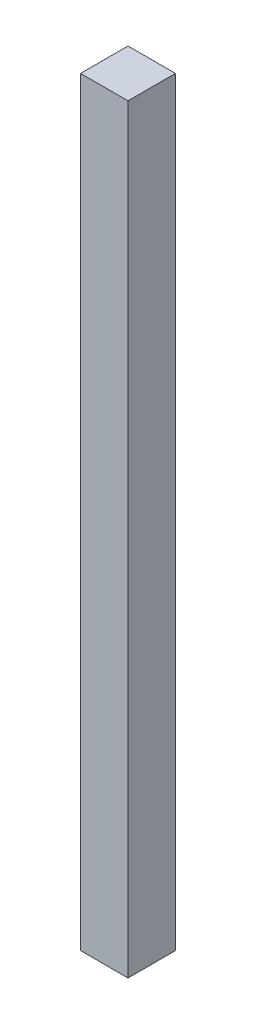
ISO-10303-21;
HEADER;
FILE_DESCRIPTION(('STEP AP214'),'2;1');
FILE_NAME('part.step','',(''),(''),'','','');
FILE_SCHEMA(('AUTOMOTIVE_DESIGN { 1 0 10303 214 1 1 1 1 }'));
ENDSEC;
DATA;
#1=APPLICATION_CONTEXT('core data for automotive mechanical design processes');
#2=APPLICATION_PROTOCOL_DEFINITION('international standard','automotive_design',2000,#1);
#3=PRODUCT_CONTEXT('',#1,'mechanical');
#4=PRODUCT('Part','Part','',(#3));
#5=PRODUCT_RELATED_PRODUCT_CATEGORY('part','',(#4));
#6=PRODUCT_DEFINITION_FORMATION('','',#4);
#7=PRODUCT_DEFINITION_CONTEXT('part definition',#1,'design');
#8=PRODUCT_DEFINITION('design','',#6,#7);
#9=PRODUCT_DEFINITION_SHAPE('','',#8);
#10=(LENGTH_UNIT() NAMED_UNIT(*) SI_UNIT(.MILLI.,.METRE.));
#11=(NAMED_UNIT(*) PLANE_ANGLE_UNIT() SI_UNIT($,.RADIAN.));
#12=(NAMED_UNIT(*) SI_UNIT($,.STERADIAN.) SOLID_ANGLE_UNIT());
#13=UNCERTAINTY_MEASURE_WITH_UNIT(LENGTH_MEASURE(1.E-05),#10,'distance_accuracy_value','');
#14=(GEOMETRIC_REPRESENTATION_CONTEXT(3) GLOBAL_UNCERTAINTY_ASSIGNED_CONTEXT((#13)) GLOBAL_UNIT_ASSIGNED_CONTEXT((#10,
#11,#12)) REPRESENTATION_CONTEXT('',''));
#15=CARTESIAN_POINT('',(0.,0.,0.));
#16=DIRECTION('',(0.,0.,1.));
#17=DIRECTION('',(1.,0.,0.));
#18=AXIS2_PLACEMENT_3D('',#15,#16,#17);
#19=CARTESIAN_POINT('',(10.,320.,10.));
#20=DIRECTION('',(-1.,0.,0.));
#21=DIRECTION('',(0.,0.,1.));
#22=AXIS2_PLACEMENT_3D('',#19,#20,#21);
#23=PLANE('',#22);
#24=DIRECTION('',(0.,0.,-1.));
#25=VECTOR('',#24,1.);
#26=CARTESIAN_POINT('',(10.,0.,10.));
#27=LINE('',#26,#25);
#28=CARTESIAN_POINT('',(10.,0.,10.));
#29=VERTEX_POINT('',#28);
#30=CARTESIAN_POINT('',(10.,0.,-10.));
#31=VERTEX_POINT('',#30);
#32=EDGE_CURVE('E96',#29,#31,#27,.T.);
#33=ORIENTED_EDGE('',*,*,#32,.T.);
#34=DIRECTION('',(0.,-1.,0.));
#35=VECTOR('',#34,1.);
#36=CARTESIAN_POINT('',(10.,320.,-10.));
#37=LINE('',#36,#35);
#38=CARTESIAN_POINT('',(10.,320.,-10.));
#39=VERTEX_POINT('',#38);
#40=EDGE_CURVE('E11',#39,#31,#37,.T.);
#41=ORIENTED_EDGE('',*,*,#40,.F.);
#42=DIRECTION('',(0.,0.,-1.));
#43=VECTOR('',#42,1.);
#44=CARTESIAN_POINT('',(10.,320.,10.));
#45=LINE('',#44,#43);
#46=CARTESIAN_POINT('',(10.,320.,10.));
#47=VERTEX_POINT('',#46);
#48=EDGE_CURVE('E84',#47,#39,#45,.T.);
#49=ORIENTED_EDGE('',*,*,#48,.F.);
#50=DIRECTION('',(0.,-1.,0.));
#51=VECTOR('',#50,1.);
#52=CARTESIAN_POINT('',(10.,320.,10.));
#53=LINE('',#52,#51);
#54=EDGE_CURVE('E92',#47,#29,#53,.T.);
#55=ORIENTED_EDGE('',*,*,#54,.T.);
#56=EDGE_LOOP('',(#33,#41,#49,#55));
#57=FACE_BOUND('',#56,.T.);
#58=ADVANCED_FACE('F33',(#57),#23,.F.);
#59=CARTESIAN_POINT('',(-10.,320.,-10.));
#60=DIRECTION('',(0.,0.,1.));
#61=DIRECTION('',(1.,0.,0.));
#62=AXIS2_PLACEMENT_3D('',#59,#60,#61);
#63=PLANE('',#62);
#64=DIRECTION('',(-1.,0.,0.));
#65=VECTOR('',#64,1.);
#66=CARTESIAN_POINT('',(-10.,0.,-10.));
#67=LINE('',#66,#65);
#68=CARTESIAN_POINT('',(-10.,0.,-10.));
#69=VERTEX_POINT('',#68);
#70=EDGE_CURVE('E88',#31,#69,#67,.T.);
#71=ORIENTED_EDGE('',*,*,#70,.T.);
#72=DIRECTION('',(0.,-1.,0.));
#73=VECTOR('',#72,1.);
#74=CARTESIAN_POINT('',(-10.,320.,-10.));
#75=LINE('',#74,#73);
#76=CARTESIAN_POINT('',(-10.,320.,-10.));
#77=VERTEX_POINT('',#76);
#78=EDGE_CURVE('E41',#77,#69,#75,.T.);
#79=ORIENTED_EDGE('',*,*,#78,.F.);
#80=DIRECTION('',(-1.,0.,0.));
#81=VECTOR('',#80,1.);
#82=CARTESIAN_POINT('',(-10.,320.,-10.));
#83=LINE('',#82,#81);
#84=EDGE_CURVE('E79',#39,#77,#83,.T.);
#85=ORIENTED_EDGE('',*,*,#84,.F.);
#86=ORIENTED_EDGE('',*,*,#40,.T.);
#87=EDGE_LOOP('',(#71,#79,#85,#86));
#88=FACE_BOUND('',#87,.T.);
#89=ADVANCED_FACE('F87',(#88),#63,.F.);
#90=CARTESIAN_POINT('',(-10.,320.,10.));
#91=DIRECTION('',(1.,0.,0.));
#92=DIRECTION('',(0.,0.,-1.));
#93=AXIS2_PLACEMENT_3D('',#90,#91,#92);
#94=PLANE('',#93);
#95=DIRECTION('',(0.,0.,1.));
#96=VECTOR('',#95,1.);
#97=CARTESIAN_POINT('',(-10.,0.,10.));
#98=LINE('',#97,#96);
#99=CARTESIAN_POINT('',(-10.,0.,10.));
#100=VERTEX_POINT('',#99);
#101=EDGE_CURVE('E66',#69,#100,#98,.T.);
#102=ORIENTED_EDGE('',*,*,#101,.T.);
#103=DIRECTION('',(0.,-1.,0.));
#104=VECTOR('',#103,1.);
#105=CARTESIAN_POINT('',(-10.,320.,10.));
#106=LINE('',#105,#104);
#107=CARTESIAN_POINT('',(-10.,320.,10.));
#108=VERTEX_POINT('',#107);
#109=EDGE_CURVE('E89',#108,#100,#106,.T.);
#110=ORIENTED_EDGE('',*,*,#109,.F.);
#111=DIRECTION('',(0.,0.,1.));
#112=VECTOR('',#111,1.);
#113=CARTESIAN_POINT('',(-10.,320.,10.));
#114=LINE('',#113,#112);
#115=EDGE_CURVE('E82',#77,#108,#114,.T.);
#116=ORIENTED_EDGE('',*,*,#115,.F.);
#117=ORIENTED_EDGE('',*,*,#78,.T.);
#118=EDGE_LOOP('',(#102,#110,#116,#117));
#119=FACE_BOUND('',#118,.T.);
#120=ADVANCED_FACE('F90',(#119),#94,.F.);
#121=CARTESIAN_POINT('',(-10.,320.,10.));
#122=DIRECTION('',(0.,0.,-1.));
#123=DIRECTION('',(-1.,0.,0.));
#124=AXIS2_PLACEMENT_3D('',#121,#122,#123);
#125=PLANE('',#124);
#126=DIRECTION('',(1.,0.,0.));
#127=VECTOR('',#126,1.);
#128=CARTESIAN_POINT('',(-10.,0.,10.));
#129=LINE('',#128,#127);
#130=EDGE_CURVE('E72',#100,#29,#129,.T.);
#131=ORIENTED_EDGE('',*,*,#130,.T.);
#132=ORIENTED_EDGE('',*,*,#54,.F.);
#133=DIRECTION('',(1.,0.,0.));
#134=VECTOR('',#133,1.);
#135=CARTESIAN_POINT('',(-10.,320.,10.));
#136=LINE('',#135,#134);
#137=EDGE_CURVE('E49',#108,#47,#136,.T.);
#138=ORIENTED_EDGE('',*,*,#137,.F.);
#139=ORIENTED_EDGE('',*,*,#109,.T.);
#140=EDGE_LOOP('',(#131,#132,#138,#139));
#141=FACE_BOUND('',#140,.T.);
#142=ADVANCED_FACE('F103',(#141),#125,.F.);
#143=CARTESIAN_POINT('',(0.,320.,0.));
#144=DIRECTION('',(0.,-1.,0.));
#145=DIRECTION('',(0.,0.,-1.));
#146=AXIS2_PLACEMENT_3D('',#143,#144,#145);
#147=PLANE('',#146);
#148=ORIENTED_EDGE('',*,*,#48,.T.);
#149=ORIENTED_EDGE('',*,*,#84,.T.);
#150=ORIENTED_EDGE('',*,*,#115,.T.);
#151=ORIENTED_EDGE('',*,*,#137,.T.);
#152=EDGE_LOOP('',(#148,#149,#150,#151));
#153=FACE_BOUND('',#152,.T.);
#154=ADVANCED_FACE('F80',(#153),#147,.F.);
#155=CARTESIAN_POINT('',(0.,0.,0.));
#156=DIRECTION('',(0.,-1.,0.));
#157=DIRECTION('',(0.,0.,-1.));
#158=AXIS2_PLACEMENT_3D('',#155,#156,#157);
#159=PLANE('',#158);
#160=ORIENTED_EDGE('',*,*,#32,.F.);
#161=ORIENTED_EDGE('',*,*,#130,.F.);
#162=ORIENTED_EDGE('',*,*,#101,.F.);
#163=ORIENTED_EDGE('',*,*,#70,.F.);
#164=EDGE_LOOP('',(#160,#161,#162,#163));
#165=FACE_BOUND('',#164,.T.);
#166=ADVANCED_FACE('F106',(#165),#159,.T.);
#167=CLOSED_SHELL('',(#58,#89,#120,#142,#154,#166));
#168=MANIFOLD_SOLID_BREP('B2',#167);
#169=ADVANCED_BREP_SHAPE_REPRESENTATION('',(#18,#168),#14);
#170=SHAPE_DEFINITION_REPRESENTATION(#9,#169);
ENDSEC;
END-ISO-10303-21;
